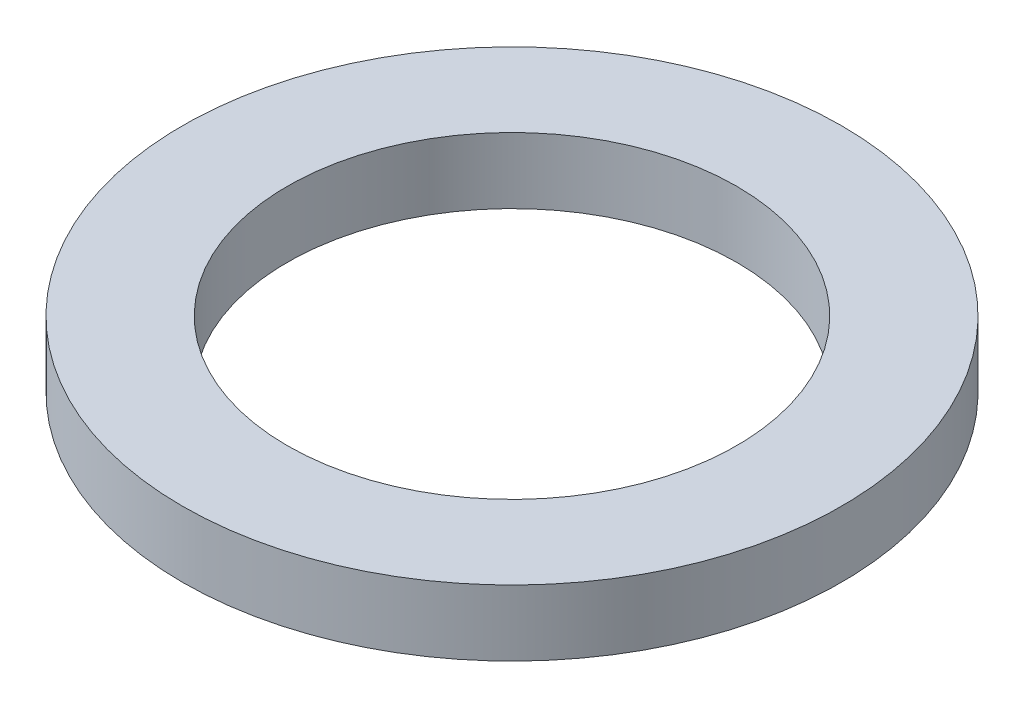
ISO-10303-21;
HEADER;
FILE_DESCRIPTION(('STEP AP214'),'2;1');
FILE_NAME('part.step','',(''),(''),'','','');
FILE_SCHEMA(('AUTOMOTIVE_DESIGN { 1 0 10303 214 1 1 1 1 }'));
ENDSEC;
DATA;
#1=APPLICATION_CONTEXT('core data for automotive mechanical design processes');
#2=APPLICATION_PROTOCOL_DEFINITION('international standard','automotive_design',2000,#1);
#3=PRODUCT_CONTEXT('',#1,'mechanical');
#4=PRODUCT('Part','Part','',(#3));
#5=PRODUCT_RELATED_PRODUCT_CATEGORY('part','',(#4));
#6=PRODUCT_DEFINITION_FORMATION('','',#4);
#7=PRODUCT_DEFINITION_CONTEXT('part definition',#1,'design');
#8=PRODUCT_DEFINITION('design','',#6,#7);
#9=PRODUCT_DEFINITION_SHAPE('','',#8);
#10=(LENGTH_UNIT() NAMED_UNIT(*) SI_UNIT(.MILLI.,.METRE.));
#11=(NAMED_UNIT(*) PLANE_ANGLE_UNIT() SI_UNIT($,.RADIAN.));
#12=(NAMED_UNIT(*) SI_UNIT($,.STERADIAN.) SOLID_ANGLE_UNIT());
#13=UNCERTAINTY_MEASURE_WITH_UNIT(LENGTH_MEASURE(1.E-05),#10,'distance_accuracy_value','');
#14=(GEOMETRIC_REPRESENTATION_CONTEXT(3) GLOBAL_UNCERTAINTY_ASSIGNED_CONTEXT((#13)) GLOBAL_UNIT_ASSIGNED_CONTEXT((#10,
#11,#12)) REPRESENTATION_CONTEXT('',''));
#15=CARTESIAN_POINT('',(0.,0.,0.));
#16=DIRECTION('',(0.,0.,1.));
#17=DIRECTION('',(1.,0.,0.));
#18=AXIS2_PLACEMENT_3D('',#15,#16,#17);
#19=CARTESIAN_POINT('',(0.,11.,0.));
#20=DIRECTION('',(0.,-1.,0.));
#21=DIRECTION('',(0.,0.,-1.));
#22=AXIS2_PLACEMENT_3D('',#19,#20,#21);
#23=CYLINDRICAL_SURFACE('',#22,55.);
#24=CARTESIAN_POINT('',(0.,11.,0.));
#25=DIRECTION('',(0.,1.,0.));
#26=DIRECTION('',(0.,0.,1.));
#27=AXIS2_PLACEMENT_3D('',#24,#25,#26);
#28=CIRCLE('',#27,55.);
#29=CARTESIAN_POINT('',(0.,11.,55.));
#30=VERTEX_POINT('',#29);
#31=EDGE_CURVE('E10',#30,#30,#28,.T.);
#32=ORIENTED_EDGE('',*,*,#31,.F.);
#33=EDGE_LOOP('',(#32));
#34=FACE_BOUND('',#33,.T.);
#35=CARTESIAN_POINT('',(0.,0.,0.));
#36=DIRECTION('',(0.,1.,0.));
#37=DIRECTION('',(0.,0.,1.));
#38=AXIS2_PLACEMENT_3D('',#35,#36,#37);
#39=CIRCLE('',#38,55.);
#40=CARTESIAN_POINT('',(0.,0.,55.));
#41=VERTEX_POINT('',#40);
#42=EDGE_CURVE('E37',#41,#41,#39,.T.);
#43=ORIENTED_EDGE('',*,*,#42,.T.);
#44=EDGE_LOOP('',(#43));
#45=FACE_BOUND('',#44,.T.);
#46=ADVANCED_FACE('F40',(#34,#45),#23,.T.);
#47=CARTESIAN_POINT('',(0.,11.,0.));
#48=DIRECTION('',(0.,1.,0.));
#49=DIRECTION('',(0.,0.,1.));
#50=AXIS2_PLACEMENT_3D('',#47,#48,#49);
#51=PLANE('',#50);
#52=CARTESIAN_POINT('',(0.,11.,0.));
#53=DIRECTION('',(0.,1.,0.));
#54=DIRECTION('',(0.,0.,1.));
#55=AXIS2_PLACEMENT_3D('',#52,#53,#54);
#56=CIRCLE('',#55,37.5);
#57=CARTESIAN_POINT('',(0.,11.,37.5));
#58=VERTEX_POINT('',#57);
#59=EDGE_CURVE('E50',#58,#58,#56,.T.);
#60=ORIENTED_EDGE('',*,*,#59,.F.);
#61=EDGE_LOOP('',(#60));
#62=FACE_BOUND('',#61,.T.);
#63=ORIENTED_EDGE('',*,*,#31,.T.);
#64=EDGE_LOOP('',(#63));
#65=FACE_BOUND('',#64,.T.);
#66=ADVANCED_FACE('F59',(#62,#65),#51,.T.);
#67=CARTESIAN_POINT('',(0.,0.,0.));
#68=DIRECTION('',(0.,1.,0.));
#69=DIRECTION('',(0.,0.,1.));
#70=AXIS2_PLACEMENT_3D('',#67,#68,#69);
#71=PLANE('',#70);
#72=CARTESIAN_POINT('',(0.,0.,0.));
#73=DIRECTION('',(0.,1.,0.));
#74=DIRECTION('',(0.,0.,1.));
#75=AXIS2_PLACEMENT_3D('',#72,#73,#74);
#76=CIRCLE('',#75,37.5);
#77=CARTESIAN_POINT('',(0.,0.,37.5));
#78=VERTEX_POINT('',#77);
#79=EDGE_CURVE('E47',#78,#78,#76,.T.);
#80=ORIENTED_EDGE('',*,*,#79,.T.);
#81=EDGE_LOOP('',(#80));
#82=FACE_BOUND('',#81,.T.);
#83=ORIENTED_EDGE('',*,*,#42,.F.);
#84=EDGE_LOOP('',(#83));
#85=FACE_BOUND('',#84,.T.);
#86=ADVANCED_FACE('F58',(#82,#85),#71,.F.);
#87=CARTESIAN_POINT('',(0.,11.,0.));
#88=DIRECTION('',(0.,-1.,0.));
#89=DIRECTION('',(0.,0.,-1.));
#90=AXIS2_PLACEMENT_3D('',#87,#88,#89);
#91=CYLINDRICAL_SURFACE('',#90,37.5);
#92=ORIENTED_EDGE('',*,*,#59,.T.);
#93=EDGE_LOOP('',(#92));
#94=FACE_BOUND('',#93,.T.);
#95=ORIENTED_EDGE('',*,*,#79,.F.);
#96=EDGE_LOOP('',(#95));
#97=FACE_BOUND('',#96,.T.);
#98=ADVANCED_FACE('F54',(#94,#97),#91,.F.);
#99=CLOSED_SHELL('',(#46,#66,#86,#98));
#100=MANIFOLD_SOLID_BREP('B2',#99);
#101=ADVANCED_BREP_SHAPE_REPRESENTATION('',(#18,#100),#14);
#102=SHAPE_DEFINITION_REPRESENTATION(#9,#101);
ENDSEC;
END-ISO-10303-21;
